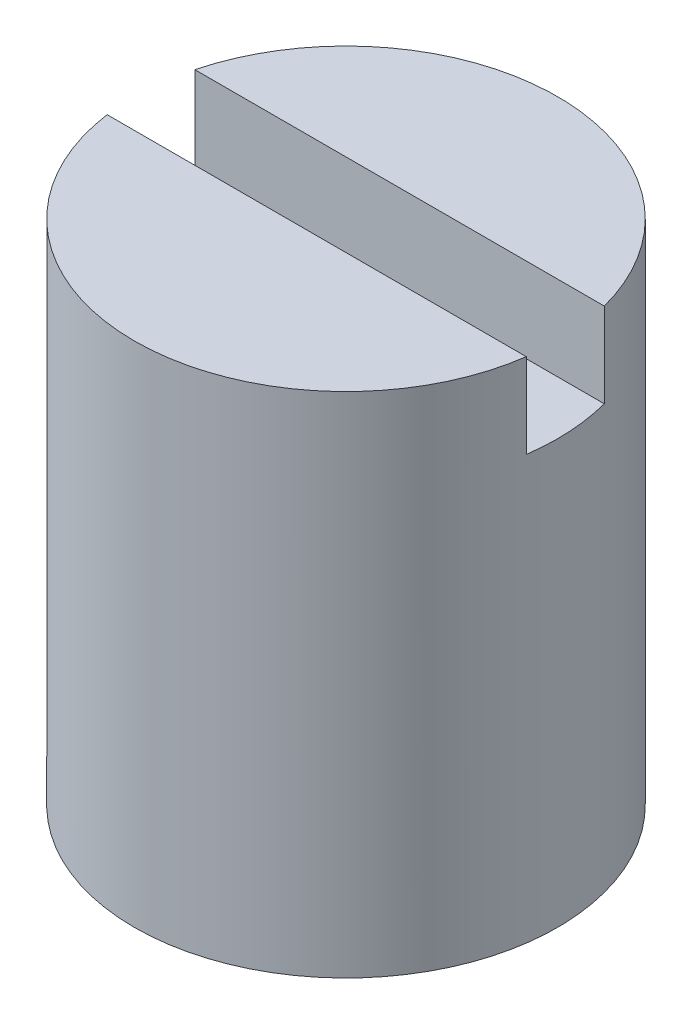
ISO-10303-21;
HEADER;
FILE_DESCRIPTION(('STEP AP214'),'2;1');
FILE_NAME('part.step','',(''),(''),'','','');
FILE_SCHEMA(('AUTOMOTIVE_DESIGN { 1 0 10303 214 1 1 1 1 }'));
ENDSEC;
DATA;
#1=APPLICATION_CONTEXT('core data for automotive mechanical design processes');
#2=APPLICATION_PROTOCOL_DEFINITION('international standard','automotive_design',2000,#1);
#3=PRODUCT_CONTEXT('',#1,'mechanical');
#4=PRODUCT('Part','Part','',(#3));
#5=PRODUCT_RELATED_PRODUCT_CATEGORY('part','',(#4));
#6=PRODUCT_DEFINITION_FORMATION('','',#4);
#7=PRODUCT_DEFINITION_CONTEXT('part definition',#1,'design');
#8=PRODUCT_DEFINITION('design','',#6,#7);
#9=PRODUCT_DEFINITION_SHAPE('','',#8);
#10=(LENGTH_UNIT() NAMED_UNIT(*) SI_UNIT(.MILLI.,.METRE.));
#11=(NAMED_UNIT(*) PLANE_ANGLE_UNIT() SI_UNIT($,.RADIAN.));
#12=(NAMED_UNIT(*) SI_UNIT($,.STERADIAN.) SOLID_ANGLE_UNIT());
#13=UNCERTAINTY_MEASURE_WITH_UNIT(LENGTH_MEASURE(1.E-05),#10,'distance_accuracy_value','');
#14=(GEOMETRIC_REPRESENTATION_CONTEXT(3) GLOBAL_UNCERTAINTY_ASSIGNED_CONTEXT((#13)) GLOBAL_UNIT_ASSIGNED_CONTEXT((#10,
#11,#12)) REPRESENTATION_CONTEXT('',''));
#15=CARTESIAN_POINT('',(0.,0.,0.));
#16=DIRECTION('',(0.,0.,1.));
#17=DIRECTION('',(1.,0.,0.));
#18=AXIS2_PLACEMENT_3D('',#15,#16,#17);
#19=CARTESIAN_POINT('',(0.,18.,0.));
#20=DIRECTION('',(0.,1.,0.));
#21=DIRECTION('',(0.,0.,1.));
#22=AXIS2_PLACEMENT_3D('',#19,#20,#21);
#23=PLANE('',#22);
#24=DIRECTION('',(-1.,0.,0.));
#25=VECTOR('',#24,1.);
#26=CARTESIAN_POINT('',(0.,18.,-1.89905648650498));
#27=LINE('',#26,#25);
#28=CARTESIAN_POINT('',(7.25558987685105,18.,-1.89905648650498));
#29=VERTEX_POINT('',#28);
#30=CARTESIAN_POINT('',(-7.25558987685105,18.,-1.89905648650498));
#31=VERTEX_POINT('',#30);
#32=EDGE_CURVE('E92',#29,#31,#27,.T.);
#33=ORIENTED_EDGE('',*,*,#32,.F.);
#34=CARTESIAN_POINT('',(0.,18.,0.));
#35=DIRECTION('',(0.,1.,0.));
#36=DIRECTION('',(0.,0.,1.));
#37=AXIS2_PLACEMENT_3D('',#34,#35,#36);
#38=CIRCLE('',#37,7.5);
#39=EDGE_CURVE('E93',#29,#31,#38,.T.);
#40=ORIENTED_EDGE('',*,*,#39,.T.);
#41=EDGE_LOOP('',(#33,#40));
#42=FACE_BOUND('',#41,.T.);
#43=ADVANCED_FACE('F43',(#42),#23,.T.);
#44=CARTESIAN_POINT('',(0.,18.,0.));
#45=DIRECTION('',(0.,-1.,0.));
#46=DIRECTION('',(0.,0.,-1.));
#47=AXIS2_PLACEMENT_3D('',#44,#45,#46);
#48=CYLINDRICAL_SURFACE('',#47,7.5);
#49=ORIENTED_EDGE('',*,*,#39,.F.);
#50=DIRECTION('',(0.,-1.,0.));
#51=VECTOR('',#50,1.);
#52=CARTESIAN_POINT('',(7.25558987685104,18.,-1.89905648650498));
#53=LINE('',#52,#51);
#54=CARTESIAN_POINT('',(7.25558987685105,15.,-1.89905648650498));
#55=VERTEX_POINT('',#54);
#56=EDGE_CURVE('E112',#29,#55,#53,.T.);
#57=ORIENTED_EDGE('',*,*,#56,.T.);
#58=CARTESIAN_POINT('',(0.,15.,0.));
#59=DIRECTION('',(0.,1.,0.));
#60=DIRECTION('',(0.,0.,1.));
#61=AXIS2_PLACEMENT_3D('',#58,#59,#60);
#62=CIRCLE('',#61,7.5);
#63=CARTESIAN_POINT('',(7.42799318057338,15.,1.03678218992964));
#64=VERTEX_POINT('',#63);
#65=EDGE_CURVE('E11',#64,#55,#62,.T.);
#66=ORIENTED_EDGE('',*,*,#65,.F.);
#67=DIRECTION('',(0.,-1.,0.));
#68=VECTOR('',#67,1.);
#69=CARTESIAN_POINT('',(7.42799318057338,18.,1.03678218992964));
#70=LINE('',#69,#68);
#71=CARTESIAN_POINT('',(7.42799318057338,18.,1.03678218992964));
#72=VERTEX_POINT('',#71);
#73=EDGE_CURVE('E86',#64,#72,#70,.F.);
#74=ORIENTED_EDGE('',*,*,#73,.T.);
#75=CARTESIAN_POINT('',(-7.42799318057338,18.,1.03678218992964));
#76=VERTEX_POINT('',#75);
#77=EDGE_CURVE('E99',#76,#72,#38,.T.);
#78=ORIENTED_EDGE('',*,*,#77,.F.);
#79=DIRECTION('',(0.,-1.,0.));
#80=VECTOR('',#79,1.);
#81=CARTESIAN_POINT('',(-7.42799318057338,18.,1.03678218992964));
#82=LINE('',#81,#80);
#83=CARTESIAN_POINT('',(-7.42799318057338,15.,1.03678218992964));
#84=VERTEX_POINT('',#83);
#85=EDGE_CURVE('E59',#76,#84,#82,.T.);
#86=ORIENTED_EDGE('',*,*,#85,.T.);
#87=CARTESIAN_POINT('',(-7.25558987685105,15.,-1.89905648650498));
#88=VERTEX_POINT('',#87);
#89=EDGE_CURVE('E47',#88,#84,#62,.T.);
#90=ORIENTED_EDGE('',*,*,#89,.F.);
#91=DIRECTION('',(0.,-1.,0.));
#92=VECTOR('',#91,1.);
#93=CARTESIAN_POINT('',(-7.25558987685104,18.,-1.89905648650498));
#94=LINE('',#93,#92);
#95=EDGE_CURVE('E67',#88,#31,#94,.F.);
#96=ORIENTED_EDGE('',*,*,#95,.T.);
#97=EDGE_LOOP('',(#49,#57,#66,#74,#78,#86,#90,#96));
#98=FACE_BOUND('',#97,.T.);
#99=CARTESIAN_POINT('',(0.,0.,0.));
#100=DIRECTION('',(0.,1.,0.));
#101=DIRECTION('',(0.,0.,1.));
#102=AXIS2_PLACEMENT_3D('',#99,#100,#101);
#103=CIRCLE('',#102,7.5);
#104=CARTESIAN_POINT('',(0.,0.,7.5));
#105=VERTEX_POINT('',#104);
#106=EDGE_CURVE('E106',#105,#105,#103,.T.);
#107=ORIENTED_EDGE('',*,*,#106,.T.);
#108=EDGE_LOOP('',(#107));
#109=FACE_BOUND('',#108,.T.);
#110=ADVANCED_FACE('F45',(#98,#109),#48,.T.);
#111=DIRECTION('',(1.,0.,0.));
#112=VECTOR('',#111,1.);
#113=CARTESIAN_POINT('',(0.,18.,1.03678218992964));
#114=LINE('',#113,#112);
#115=EDGE_CURVE('E83',#76,#72,#114,.T.);
#116=ORIENTED_EDGE('',*,*,#115,.F.);
#117=ORIENTED_EDGE('',*,*,#77,.T.);
#118=EDGE_LOOP('',(#116,#117));
#119=FACE_BOUND('',#118,.T.);
#120=ADVANCED_FACE('F104',(#119),#23,.T.);
#121=CARTESIAN_POINT('',(0.,0.,0.));
#122=DIRECTION('',(0.,1.,0.));
#123=DIRECTION('',(0.,0.,1.));
#124=AXIS2_PLACEMENT_3D('',#121,#122,#123);
#125=PLANE('',#124);
#126=ORIENTED_EDGE('',*,*,#106,.F.);
#127=EDGE_LOOP('',(#126));
#128=FACE_BOUND('',#127,.T.);
#129=ADVANCED_FACE('F140',(#128),#125,.F.);
#130=CARTESIAN_POINT('',(0.,15.,0.));
#131=DIRECTION('',(0.,1.,0.));
#132=DIRECTION('',(0.,0.,1.));
#133=AXIS2_PLACEMENT_3D('',#130,#131,#132);
#134=PLANE('',#133);
#135=ORIENTED_EDGE('',*,*,#65,.T.);
#136=DIRECTION('',(-1.,0.,0.));
#137=VECTOR('',#136,1.);
#138=CARTESIAN_POINT('',(-12.681065569063,15.,-1.89905648650498));
#139=LINE('',#138,#137);
#140=EDGE_CURVE('E102',#55,#88,#139,.T.);
#141=ORIENTED_EDGE('',*,*,#140,.T.);
#142=ORIENTED_EDGE('',*,*,#89,.T.);
#143=DIRECTION('',(1.,0.,0.));
#144=VECTOR('',#143,1.);
#145=CARTESIAN_POINT('',(-12.681065569063,15.,1.03678218992964));
#146=LINE('',#145,#144);
#147=EDGE_CURVE('E122',#84,#64,#146,.T.);
#148=ORIENTED_EDGE('',*,*,#147,.T.);
#149=EDGE_LOOP('',(#135,#141,#142,#148));
#150=FACE_BOUND('',#149,.T.);
#151=ADVANCED_FACE('F121',(#150),#134,.T.);
#152=CARTESIAN_POINT('',(-12.681065569063,15.,-1.89905648650498));
#153=DIRECTION('',(0.,0.,-1.));
#154=DIRECTION('',(-1.,0.,0.));
#155=AXIS2_PLACEMENT_3D('',#152,#153,#154);
#156=PLANE('',#155);
#157=ORIENTED_EDGE('',*,*,#32,.T.);
#158=ORIENTED_EDGE('',*,*,#95,.F.);
#159=ORIENTED_EDGE('',*,*,#140,.F.);
#160=ORIENTED_EDGE('',*,*,#56,.F.);
#161=EDGE_LOOP('',(#157,#158,#159,#160));
#162=FACE_BOUND('',#161,.T.);
#163=ADVANCED_FACE('F131',(#162),#156,.F.);
#164=CARTESIAN_POINT('',(-12.681065569063,15.,1.03678218992964));
#165=DIRECTION('',(0.,0.,1.));
#166=DIRECTION('',(1.,0.,0.));
#167=AXIS2_PLACEMENT_3D('',#164,#165,#166);
#168=PLANE('',#167);
#169=ORIENTED_EDGE('',*,*,#115,.T.);
#170=ORIENTED_EDGE('',*,*,#73,.F.);
#171=ORIENTED_EDGE('',*,*,#147,.F.);
#172=ORIENTED_EDGE('',*,*,#85,.F.);
#173=EDGE_LOOP('',(#169,#170,#171,#172));
#174=FACE_BOUND('',#173,.T.);
#175=ADVANCED_FACE('F85',(#174),#168,.F.);
#176=CLOSED_SHELL('',(#43,#110,#120,#129,#151,#163,#175));
#177=MANIFOLD_SOLID_BREP('B2',#176);
#178=ADVANCED_BREP_SHAPE_REPRESENTATION('',(#18,#177),#14);
#179=SHAPE_DEFINITION_REPRESENTATION(#9,#178);
ENDSEC;
END-ISO-10303-21;
